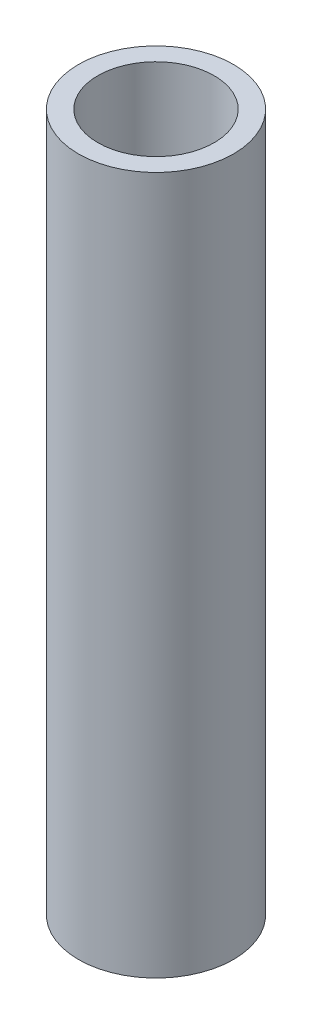
ISO-10303-21;
HEADER;
FILE_DESCRIPTION(('STEP AP214'),'2;1');
FILE_NAME('part.step','',(''),(''),'','','');
FILE_SCHEMA(('AUTOMOTIVE_DESIGN { 1 0 10303 214 1 1 1 1 }'));
ENDSEC;
DATA;
#1=APPLICATION_CONTEXT('core data for automotive mechanical design processes');
#2=APPLICATION_PROTOCOL_DEFINITION('international standard','automotive_design',2000,#1);
#3=PRODUCT_CONTEXT('',#1,'mechanical');
#4=PRODUCT('Part','Part','',(#3));
#5=PRODUCT_RELATED_PRODUCT_CATEGORY('part','',(#4));
#6=PRODUCT_DEFINITION_FORMATION('','',#4);
#7=PRODUCT_DEFINITION_CONTEXT('part definition',#1,'design');
#8=PRODUCT_DEFINITION('design','',#6,#7);
#9=PRODUCT_DEFINITION_SHAPE('','',#8);
#10=(LENGTH_UNIT() NAMED_UNIT(*) SI_UNIT(.MILLI.,.METRE.));
#11=(NAMED_UNIT(*) PLANE_ANGLE_UNIT() SI_UNIT($,.RADIAN.));
#12=(NAMED_UNIT(*) SI_UNIT($,.STERADIAN.) SOLID_ANGLE_UNIT());
#13=UNCERTAINTY_MEASURE_WITH_UNIT(LENGTH_MEASURE(1.E-05),#10,'distance_accuracy_value','');
#14=(GEOMETRIC_REPRESENTATION_CONTEXT(3) GLOBAL_UNCERTAINTY_ASSIGNED_CONTEXT((#13)) GLOBAL_UNIT_ASSIGNED_CONTEXT((#10,
#11,#12)) REPRESENTATION_CONTEXT('',''));
#15=CARTESIAN_POINT('',(0.,0.,0.));
#16=DIRECTION('',(0.,0.,1.));
#17=DIRECTION('',(1.,0.,0.));
#18=AXIS2_PLACEMENT_3D('',#15,#16,#17);
#19=CARTESIAN_POINT('',(0.,114.3,0.));
#20=DIRECTION('',(0.,1.,0.));
#21=DIRECTION('',(0.,0.,1.));
#22=AXIS2_PLACEMENT_3D('',#19,#20,#21);
#23=PLANE('',#22);
#24=CARTESIAN_POINT('',(0.,114.3,0.));
#25=DIRECTION('',(0.,1.,0.));
#26=DIRECTION('',(0.,0.,1.));
#27=AXIS2_PLACEMENT_3D('',#24,#25,#26);
#28=CIRCLE('',#27,12.7);
#29=CARTESIAN_POINT('',(0.,114.3,12.7));
#30=VERTEX_POINT('',#29);
#31=EDGE_CURVE('E10',#30,#30,#28,.T.);
#32=ORIENTED_EDGE('',*,*,#31,.T.);
#33=EDGE_LOOP('',(#32));
#34=FACE_BOUND('',#33,.T.);
#35=CARTESIAN_POINT('',(0.,114.3,0.));
#36=DIRECTION('',(0.,1.,0.));
#37=DIRECTION('',(0.,0.,1.));
#38=AXIS2_PLACEMENT_3D('',#35,#36,#37);
#39=CIRCLE('',#38,9.52500000000002);
#40=CARTESIAN_POINT('',(0.,114.3,9.52500000000002));
#41=VERTEX_POINT('',#40);
#42=EDGE_CURVE('E43',#41,#41,#39,.T.);
#43=ORIENTED_EDGE('',*,*,#42,.F.);
#44=EDGE_LOOP('',(#43));
#45=FACE_BOUND('',#44,.T.);
#46=ADVANCED_FACE('F32',(#34,#45),#23,.T.);
#47=CARTESIAN_POINT('',(0.,0.,0.));
#48=DIRECTION('',(0.,1.,0.));
#49=DIRECTION('',(0.,0.,1.));
#50=AXIS2_PLACEMENT_3D('',#47,#48,#49);
#51=PLANE('',#50);
#52=CARTESIAN_POINT('',(0.,0.,0.));
#53=DIRECTION('',(0.,1.,0.));
#54=DIRECTION('',(0.,0.,1.));
#55=AXIS2_PLACEMENT_3D('',#52,#53,#54);
#56=CIRCLE('',#55,12.7);
#57=CARTESIAN_POINT('',(0.,0.,12.7));
#58=VERTEX_POINT('',#57);
#59=EDGE_CURVE('E36',#58,#58,#56,.T.);
#60=ORIENTED_EDGE('',*,*,#59,.F.);
#61=EDGE_LOOP('',(#60));
#62=FACE_BOUND('',#61,.T.);
#63=CARTESIAN_POINT('',(0.,0.,0.));
#64=DIRECTION('',(0.,1.,0.));
#65=DIRECTION('',(0.,0.,1.));
#66=AXIS2_PLACEMENT_3D('',#63,#64,#65);
#67=CIRCLE('',#66,9.52500000000002);
#68=CARTESIAN_POINT('',(0.,0.,9.52500000000002));
#69=VERTEX_POINT('',#68);
#70=EDGE_CURVE('E45',#69,#69,#67,.T.);
#71=ORIENTED_EDGE('',*,*,#70,.T.);
#72=EDGE_LOOP('',(#71));
#73=FACE_BOUND('',#72,.T.);
#74=ADVANCED_FACE('F55',(#62,#73),#51,.F.);
#75=CARTESIAN_POINT('',(0.,114.3,0.));
#76=DIRECTION('',(0.,-1.,0.));
#77=DIRECTION('',(0.,0.,-1.));
#78=AXIS2_PLACEMENT_3D('',#75,#76,#77);
#79=CYLINDRICAL_SURFACE('',#78,12.7);
#80=ORIENTED_EDGE('',*,*,#31,.F.);
#81=EDGE_LOOP('',(#80));
#82=FACE_BOUND('',#81,.T.);
#83=ORIENTED_EDGE('',*,*,#59,.T.);
#84=EDGE_LOOP('',(#83));
#85=FACE_BOUND('',#84,.T.);
#86=ADVANCED_FACE('F34',(#82,#85),#79,.T.);
#87=CARTESIAN_POINT('',(0.,114.3,0.));
#88=DIRECTION('',(0.,-1.,0.));
#89=DIRECTION('',(0.,0.,-1.));
#90=AXIS2_PLACEMENT_3D('',#87,#88,#89);
#91=CYLINDRICAL_SURFACE('',#90,9.52500000000002);
#92=ORIENTED_EDGE('',*,*,#42,.T.);
#93=EDGE_LOOP('',(#92));
#94=FACE_BOUND('',#93,.T.);
#95=ORIENTED_EDGE('',*,*,#70,.F.);
#96=EDGE_LOOP('',(#95));
#97=FACE_BOUND('',#96,.T.);
#98=ADVANCED_FACE('F51',(#94,#97),#91,.F.);
#99=CLOSED_SHELL('',(#46,#74,#86,#98));
#100=MANIFOLD_SOLID_BREP('B2',#99);
#101=ADVANCED_BREP_SHAPE_REPRESENTATION('',(#18,#100),#14);
#102=SHAPE_DEFINITION_REPRESENTATION(#9,#101);
ENDSEC;
END-ISO-10303-21;
